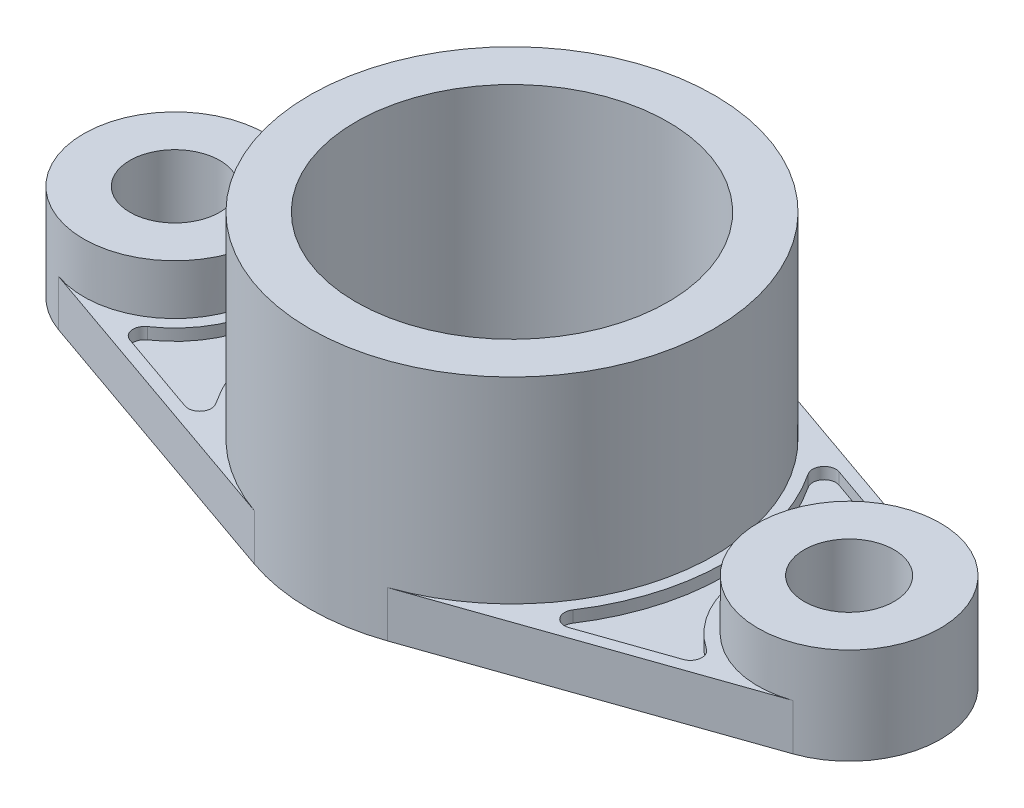
ISO-10303-21;
HEADER;
FILE_DESCRIPTION(('STEP AP214'),'2;1');
FILE_NAME('part.step','',(''),(''),'','','');
FILE_SCHEMA(('AUTOMOTIVE_DESIGN { 1 0 10303 214 1 1 1 1 }'));
ENDSEC;
DATA;
#1=APPLICATION_CONTEXT('core data for automotive mechanical design processes');
#2=APPLICATION_PROTOCOL_DEFINITION('international standard','automotive_design',2000,#1);
#3=PRODUCT_CONTEXT('',#1,'mechanical');
#4=PRODUCT('Part','Part','',(#3));
#5=PRODUCT_RELATED_PRODUCT_CATEGORY('part','',(#4));
#6=PRODUCT_DEFINITION_FORMATION('','',#4);
#7=PRODUCT_DEFINITION_CONTEXT('part definition',#1,'design');
#8=PRODUCT_DEFINITION('design','',#6,#7);
#9=PRODUCT_DEFINITION_SHAPE('','',#8);
#10=(LENGTH_UNIT() NAMED_UNIT(*) SI_UNIT(.MILLI.,.METRE.));
#11=(NAMED_UNIT(*) PLANE_ANGLE_UNIT() SI_UNIT($,.RADIAN.));
#12=(NAMED_UNIT(*) SI_UNIT($,.STERADIAN.) SOLID_ANGLE_UNIT());
#13=UNCERTAINTY_MEASURE_WITH_UNIT(LENGTH_MEASURE(1.E-05),#10,'distance_accuracy_value','');
#14=(GEOMETRIC_REPRESENTATION_CONTEXT(3) GLOBAL_UNCERTAINTY_ASSIGNED_CONTEXT((#13)) GLOBAL_UNIT_ASSIGNED_CONTEXT((#10,
#11,#12)) REPRESENTATION_CONTEXT('',''));
#15=CARTESIAN_POINT('',(0.,0.,0.));
#16=DIRECTION('',(0.,0.,1.));
#17=DIRECTION('',(1.,0.,0.));
#18=AXIS2_PLACEMENT_3D('',#15,#16,#17);
#19=CARTESIAN_POINT('',(0.,12.,0.));
#20=DIRECTION('',(0.,1.,0.));
#21=DIRECTION('',(0.,0.,1.));
#22=AXIS2_PLACEMENT_3D('',#19,#20,#21);
#23=PLANE('',#22);
#24=DIRECTION('',(0.944140617337334,0.,0.329542857142857));
#25=VECTOR('',#24,1.);
#26=CARTESIAN_POINT('',(-17.301,12.,49.5673824102101));
#27=LINE('',#26,#25);
#28=CARTESIAN_POINT('',(-95.2986317142857,12.,22.343087709288));
#29=VERTEX_POINT('',#28);
#30=CARTESIAN_POINT('',(-17.301,12.,49.5673824102101));
#31=VERTEX_POINT('',#30);
#32=EDGE_CURVE('E219',#29,#31,#27,.T.);
#33=ORIENTED_EDGE('',*,*,#32,.T.);
#34=CARTESIAN_POINT('',(0.,12.,0.));
#35=DIRECTION('',(0.,1.,0.));
#36=DIRECTION('',(0.,0.,1.));
#37=AXIS2_PLACEMENT_3D('',#34,#35,#36);
#38=CIRCLE('',#37,52.5);
#39=CARTESIAN_POINT('',(-17.301,12.,-49.56738241021));
#40=VERTEX_POINT('',#39);
#41=EDGE_CURVE('E239',#31,#40,#38,.F.);
#42=ORIENTED_EDGE('',*,*,#41,.T.);
#43=DIRECTION('',(0.944140617337334,0.,-0.329542857142857));
#44=VECTOR('',#43,1.);
#45=CARTESIAN_POINT('',(-17.301,12.,-49.56738241021));
#46=LINE('',#45,#44);
#47=CARTESIAN_POINT('',(-95.2986317142857,12.,-22.343087709288));
#48=VERTEX_POINT('',#47);
#49=EDGE_CURVE('E272',#48,#40,#46,.T.);
#50=ORIENTED_EDGE('',*,*,#49,.F.);
#51=CARTESIAN_POINT('',(-87.5,12.,0.));
#52=DIRECTION('',(0.,1.,0.));
#53=DIRECTION('',(0.,0.,1.));
#54=AXIS2_PLACEMENT_3D('',#51,#52,#53);
#55=CIRCLE('',#54,23.665);
#56=EDGE_CURVE('E268',#48,#29,#55,.F.);
#57=ORIENTED_EDGE('',*,*,#56,.T.);
#58=EDGE_LOOP('',(#33,#42,#50,#57));
#59=FACE_BOUND('',#58,.T.);
#60=DIRECTION('',(0.944140617337334,0.,0.329542857142857));
#61=VECTOR('',#60,1.);
#62=CARTESIAN_POINT('',(-78.3996228998575,12.,25.0640252480563));
#63=LINE('',#62,#61);
#64=CARTESIAN_POINT('',(-71.8093276206941,12.,27.3643020244495));
#65=VERTEX_POINT('',#64);
#66=CARTESIAN_POINT('',(-49.826038740367,12.,35.0373495493516));
#67=VERTEX_POINT('',#66);
#68=EDGE_CURVE('E498',#65,#67,#63,.T.);
#69=ORIENTED_EDGE('',*,*,#68,.F.);
#70=CARTESIAN_POINT('',(-70.8206990492656,12.,24.5318801724375));
#71=DIRECTION('',(0.,1.,0.));
#72=DIRECTION('',(0.,0.,1.));
#73=AXIS2_PLACEMENT_3D('',#70,#71,#72);
#74=CIRCLE('',#73,3.);
#75=CARTESIAN_POINT('',(-72.507464694039,12.,22.0509888689717));
#76=VERTEX_POINT('',#75);
#77=EDGE_CURVE('E377',#65,#76,#74,.F.);
#78=ORIENTED_EDGE('',*,*,#77,.T.);
#79=CARTESIAN_POINT('',(-87.5,12.,0.));
#80=DIRECTION('',(0.,1.,0.));
#81=DIRECTION('',(0.,0.,1.));
#82=AXIS2_PLACEMENT_3D('',#79,#80,#81);
#83=CIRCLE('',#82,26.665);
#84=CARTESIAN_POINT('',(-72.507464694039,12.,-22.0509888689717));
#85=VERTEX_POINT('',#84);
#86=EDGE_CURVE('E485',#76,#85,#83,.T.);
#87=ORIENTED_EDGE('',*,*,#86,.T.);
#88=CARTESIAN_POINT('',(-70.8206990492656,12.,-24.5318801724374));
#89=DIRECTION('',(0.,1.,0.));
#90=DIRECTION('',(0.,0.,1.));
#91=AXIS2_PLACEMENT_3D('',#88,#89,#90);
#92=CIRCLE('',#91,3.);
#93=CARTESIAN_POINT('',(-71.8093276206942,12.,-27.3643020244494));
#94=VERTEX_POINT('',#93);
#95=EDGE_CURVE('E374',#85,#94,#92,.F.);
#96=ORIENTED_EDGE('',*,*,#95,.T.);
#97=DIRECTION('',(-0.944140617337334,0.,0.329542857142857));
#98=VECTOR('',#97,1.);
#99=CARTESIAN_POINT('',(-40.010112847172,12.,-38.4635004901603));
#100=LINE('',#99,#98);
#101=CARTESIAN_POINT('',(-49.826038740367,12.,-35.0373495493516));
#102=VERTEX_POINT('',#101);
#103=EDGE_CURVE('E489',#102,#94,#100,.T.);
#104=ORIENTED_EDGE('',*,*,#103,.F.);
#105=CARTESIAN_POINT('',(-48.8374101689385,12.,-32.2049276973396));
#106=DIRECTION('',(0.,1.,0.));
#107=DIRECTION('',(0.,0.,1.));
#108=AXIS2_PLACEMENT_3D('',#105,#106,#107);
#109=CIRCLE('',#108,3.);
#110=CARTESIAN_POINT('',(-46.3329275961724,12.,-30.5533929436298));
#111=VERTEX_POINT('',#110);
#112=EDGE_CURVE('E383',#102,#111,#109,.F.);
#113=ORIENTED_EDGE('',*,*,#112,.T.);
#114=CARTESIAN_POINT('',(0.,12.,0.));
#115=DIRECTION('',(0.,1.,0.));
#116=DIRECTION('',(0.,0.,1.));
#117=AXIS2_PLACEMENT_3D('',#114,#115,#116);
#118=CIRCLE('',#117,55.5);
#119=CARTESIAN_POINT('',(-46.3329275961724,12.,30.5533929436299));
#120=VERTEX_POINT('',#119);
#121=EDGE_CURVE('E494',#111,#120,#118,.T.);
#122=ORIENTED_EDGE('',*,*,#121,.T.);
#123=CARTESIAN_POINT('',(-48.8374101689384,12.,32.2049276973396));
#124=DIRECTION('',(0.,1.,0.));
#125=DIRECTION('',(0.,0.,1.));
#126=AXIS2_PLACEMENT_3D('',#123,#124,#125);
#127=CIRCLE('',#126,3.);
#128=EDGE_CURVE('E380',#120,#67,#127,.F.);
#129=ORIENTED_EDGE('',*,*,#128,.T.);
#130=EDGE_LOOP('',(#69,#78,#87,#96,#104,#113,#122,#129));
#131=FACE_BOUND('',#130,.T.);
#132=ADVANCED_FACE('F47',(#59,#131),#23,.T.);
#133=DIRECTION('',(-0.944140617337334,0.,-0.329542857142857));
#134=VECTOR('',#133,1.);
#135=CARTESIAN_POINT('',(17.301,12.,-49.56738241021));
#136=LINE('',#135,#134);
#137=CARTESIAN_POINT('',(95.2986317142857,12.,-22.343087709288));
#138=VERTEX_POINT('',#137);
#139=CARTESIAN_POINT('',(17.301,12.,-49.56738241021));
#140=VERTEX_POINT('',#139);
#141=EDGE_CURVE('E218',#138,#140,#136,.T.);
#142=ORIENTED_EDGE('',*,*,#141,.T.);
#143=CARTESIAN_POINT('',(17.301,12.,49.56738241021));
#144=VERTEX_POINT('',#143);
#145=EDGE_CURVE('E227',#140,#144,#38,.F.);
#146=ORIENTED_EDGE('',*,*,#145,.T.);
#147=DIRECTION('',(-0.944140617337334,0.,0.329542857142857));
#148=VECTOR('',#147,1.);
#149=CARTESIAN_POINT('',(17.301,12.,49.5673824102101));
#150=LINE('',#149,#148);
#151=CARTESIAN_POINT('',(95.2986317142857,12.,22.343087709288));
#152=VERTEX_POINT('',#151);
#153=EDGE_CURVE('E207',#152,#144,#150,.T.);
#154=ORIENTED_EDGE('',*,*,#153,.F.);
#155=CARTESIAN_POINT('',(87.5,12.,0.));
#156=DIRECTION('',(0.,1.,0.));
#157=DIRECTION('',(0.,0.,1.));
#158=AXIS2_PLACEMENT_3D('',#155,#156,#157);
#159=CIRCLE('',#158,23.665);
#160=EDGE_CURVE('E257',#138,#152,#159,.T.);
#161=ORIENTED_EDGE('',*,*,#160,.F.);
#162=EDGE_LOOP('',(#142,#146,#154,#161));
#163=FACE_BOUND('',#162,.T.);
#164=DIRECTION('',(-0.944140617337334,0.,-0.329542857142857));
#165=VECTOR('',#164,1.);
#166=CARTESIAN_POINT('',(78.3996228998575,12.,-25.0640252480563));
#167=LINE('',#166,#165);
#168=CARTESIAN_POINT('',(71.8093276206941,12.,-27.3643020244494));
#169=VERTEX_POINT('',#168);
#170=CARTESIAN_POINT('',(49.826038740367,12.,-35.0373495493516));
#171=VERTEX_POINT('',#170);
#172=EDGE_CURVE('E433',#169,#171,#167,.T.);
#173=ORIENTED_EDGE('',*,*,#172,.F.);
#174=CARTESIAN_POINT('',(70.8206990492656,12.,-24.5318801724374));
#175=DIRECTION('',(0.,1.,0.));
#176=DIRECTION('',(0.,0.,1.));
#177=AXIS2_PLACEMENT_3D('',#174,#175,#176);
#178=CIRCLE('',#177,3.);
#179=CARTESIAN_POINT('',(72.507464694039,12.,-22.0509888689717));
#180=VERTEX_POINT('',#179);
#181=EDGE_CURVE('E428',#169,#180,#178,.F.);
#182=ORIENTED_EDGE('',*,*,#181,.T.);
#183=CARTESIAN_POINT('',(87.5,12.,0.));
#184=DIRECTION('',(0.,1.,0.));
#185=DIRECTION('',(0.,0.,1.));
#186=AXIS2_PLACEMENT_3D('',#183,#184,#185);
#187=CIRCLE('',#186,26.665);
#188=CARTESIAN_POINT('',(72.507464694039,12.,22.0509888689717));
#189=VERTEX_POINT('',#188);
#190=EDGE_CURVE('E490',#180,#189,#187,.T.);
#191=ORIENTED_EDGE('',*,*,#190,.T.);
#192=CARTESIAN_POINT('',(70.8206990492656,12.,24.5318801724375));
#193=DIRECTION('',(0.,1.,0.));
#194=DIRECTION('',(0.,0.,1.));
#195=AXIS2_PLACEMENT_3D('',#192,#193,#194);
#196=CIRCLE('',#195,3.);
#197=CARTESIAN_POINT('',(71.8093276206941,12.,27.3643020244495));
#198=VERTEX_POINT('',#197);
#199=EDGE_CURVE('E425',#189,#198,#196,.F.);
#200=ORIENTED_EDGE('',*,*,#199,.T.);
#201=DIRECTION('',(0.944140617337334,0.,-0.329542857142857));
#202=VECTOR('',#201,1.);
#203=CARTESIAN_POINT('',(40.010112847172,12.,38.4635004901603));
#204=LINE('',#203,#202);
#205=CARTESIAN_POINT('',(49.826038740367,12.,35.0373495493516));
#206=VERTEX_POINT('',#205);
#207=EDGE_CURVE('E505',#206,#198,#204,.T.);
#208=ORIENTED_EDGE('',*,*,#207,.F.);
#209=CARTESIAN_POINT('',(48.8374101689384,12.,32.2049276973396));
#210=DIRECTION('',(0.,1.,0.));
#211=DIRECTION('',(0.,0.,1.));
#212=AXIS2_PLACEMENT_3D('',#209,#210,#211);
#213=CIRCLE('',#212,3.);
#214=CARTESIAN_POINT('',(46.3329275961723,12.,30.5533929436299));
#215=VERTEX_POINT('',#214);
#216=EDGE_CURVE('E11',#206,#215,#213,.F.);
#217=ORIENTED_EDGE('',*,*,#216,.T.);
#218=CARTESIAN_POINT('',(0.,12.,0.));
#219=DIRECTION('',(0.,1.,0.));
#220=DIRECTION('',(0.,0.,1.));
#221=AXIS2_PLACEMENT_3D('',#218,#219,#220);
#222=CIRCLE('',#221,55.5);
#223=CARTESIAN_POINT('',(46.3329275961724,12.,-30.5533929436298));
#224=VERTEX_POINT('',#223);
#225=EDGE_CURVE('E434',#215,#224,#222,.T.);
#226=ORIENTED_EDGE('',*,*,#225,.T.);
#227=CARTESIAN_POINT('',(48.8374101689384,12.,-32.2049276973396));
#228=DIRECTION('',(0.,1.,0.));
#229=DIRECTION('',(0.,0.,1.));
#230=AXIS2_PLACEMENT_3D('',#227,#228,#229);
#231=CIRCLE('',#230,3.);
#232=EDGE_CURVE('E56',#224,#171,#231,.F.);
#233=ORIENTED_EDGE('',*,*,#232,.T.);
#234=EDGE_LOOP('',(#173,#182,#191,#200,#208,#217,#226,#233));
#235=FACE_BOUND('',#234,.T.);
#236=ADVANCED_FACE('F235',(#163,#235),#23,.T.);
#237=CARTESIAN_POINT('',(-17.301,12.,-49.56738241021));
#238=DIRECTION('',(-0.329542857142857,0.,-0.944140617337334));
#239=DIRECTION('',(-0.944140617337334,0.,0.329542857142857));
#240=AXIS2_PLACEMENT_3D('',#237,#238,#239);
#241=PLANE('',#240);
#242=DIRECTION('',(0.944140617337334,0.,-0.329542857142857));
#243=VECTOR('',#242,1.);
#244=CARTESIAN_POINT('',(-17.301,0.,-49.56738241021));
#245=LINE('',#244,#243);
#246=CARTESIAN_POINT('',(-95.2986317142857,0.,-22.343087709288));
#247=VERTEX_POINT('',#246);
#248=CARTESIAN_POINT('',(-17.301,0.,-49.56738241021));
#249=VERTEX_POINT('',#248);
#250=EDGE_CURVE('E271',#247,#249,#245,.T.);
#251=ORIENTED_EDGE('',*,*,#250,.F.);
#252=DIRECTION('',(0.,-1.,0.));
#253=VECTOR('',#252,1.);
#254=CARTESIAN_POINT('',(-95.2986317142857,12.,-22.343087709288));
#255=LINE('',#254,#253);
#256=EDGE_CURVE('E331',#48,#247,#255,.T.);
#257=ORIENTED_EDGE('',*,*,#256,.F.);
#258=ORIENTED_EDGE('',*,*,#49,.T.);
#259=DIRECTION('',(0.,-1.,0.));
#260=VECTOR('',#259,1.);
#261=CARTESIAN_POINT('',(-17.301,12.,-49.56738241021));
#262=LINE('',#261,#260);
#263=EDGE_CURVE('E281',#40,#249,#262,.T.);
#264=ORIENTED_EDGE('',*,*,#263,.T.);
#265=EDGE_LOOP('',(#251,#257,#258,#264));
#266=FACE_BOUND('',#265,.T.);
#267=ADVANCED_FACE('F538',(#266),#241,.T.);
#268=CARTESIAN_POINT('',(-87.5,12.,0.));
#269=DIRECTION('',(0.,-1.,0.));
#270=DIRECTION('',(0.,0.,-1.));
#271=AXIS2_PLACEMENT_3D('',#268,#269,#270);
#272=CYLINDRICAL_SURFACE('',#271,23.665);
#273=CARTESIAN_POINT('',(-87.5,0.,0.));
#274=DIRECTION('',(0.,1.,0.));
#275=DIRECTION('',(0.,0.,1.));
#276=AXIS2_PLACEMENT_3D('',#273,#274,#275);
#277=CIRCLE('',#276,23.665);
#278=CARTESIAN_POINT('',(-95.2986317142857,0.,22.343087709288));
#279=VERTEX_POINT('',#278);
#280=EDGE_CURVE('E285',#247,#279,#277,.T.);
#281=ORIENTED_EDGE('',*,*,#280,.T.);
#282=DIRECTION('',(0.,-1.,0.));
#283=VECTOR('',#282,1.);
#284=CARTESIAN_POINT('',(-95.2986317142857,12.,22.343087709288));
#285=LINE('',#284,#283);
#286=EDGE_CURVE('E327',#29,#279,#285,.T.);
#287=ORIENTED_EDGE('',*,*,#286,.F.);
#288=ORIENTED_EDGE('',*,*,#56,.F.);
#289=ORIENTED_EDGE('',*,*,#256,.T.);
#290=EDGE_LOOP('',(#281,#287,#288,#289));
#291=FACE_BOUND('',#290,.T.);
#292=CARTESIAN_POINT('',(-87.5,25.,0.));
#293=DIRECTION('',(0.,1.,0.));
#294=DIRECTION('',(0.,0.,1.));
#295=AXIS2_PLACEMENT_3D('',#292,#293,#294);
#296=CIRCLE('',#295,23.665);
#297=CARTESIAN_POINT('',(-87.5,25.,23.665));
#298=VERTEX_POINT('',#297);
#299=EDGE_CURVE('E264',#298,#298,#296,.T.);
#300=ORIENTED_EDGE('',*,*,#299,.F.);
#301=EDGE_LOOP('',(#300));
#302=FACE_BOUND('',#301,.T.);
#303=ADVANCED_FACE('F575',(#291,#302),#272,.T.);
#304=CARTESIAN_POINT('',(-17.301,12.,49.5673824102101));
#305=DIRECTION('',(0.329542857142857,0.,-0.944140617337334));
#306=DIRECTION('',(-0.944140617337334,0.,-0.329542857142857));
#307=AXIS2_PLACEMENT_3D('',#304,#305,#306);
#308=PLANE('',#307);
#309=DIRECTION('',(0.944140617337334,0.,0.329542857142857));
#310=VECTOR('',#309,1.);
#311=CARTESIAN_POINT('',(-17.301,0.,49.5673824102101));
#312=LINE('',#311,#310);
#313=CARTESIAN_POINT('',(-17.301,0.,49.5673824102101));
#314=VERTEX_POINT('',#313);
#315=EDGE_CURVE('E288',#279,#314,#312,.T.);
#316=ORIENTED_EDGE('',*,*,#315,.T.);
#317=DIRECTION('',(0.,-1.,0.));
#318=VECTOR('',#317,1.);
#319=CARTESIAN_POINT('',(-17.301,12.,49.5673824102101));
#320=LINE('',#319,#318);
#321=EDGE_CURVE('E233',#31,#314,#320,.T.);
#322=ORIENTED_EDGE('',*,*,#321,.F.);
#323=ORIENTED_EDGE('',*,*,#32,.F.);
#324=ORIENTED_EDGE('',*,*,#286,.T.);
#325=EDGE_LOOP('',(#316,#322,#323,#324));
#326=FACE_BOUND('',#325,.T.);
#327=ADVANCED_FACE('F572',(#326),#308,.F.);
#328=CARTESIAN_POINT('',(17.301,12.,49.5673824102101));
#329=DIRECTION('',(0.329542857142857,0.,0.944140617337334));
#330=DIRECTION('',(0.944140617337334,0.,-0.329542857142857));
#331=AXIS2_PLACEMENT_3D('',#328,#329,#330);
#332=PLANE('',#331);
#333=DIRECTION('',(-0.944140617337334,0.,0.329542857142857));
#334=VECTOR('',#333,1.);
#335=CARTESIAN_POINT('',(17.301,0.,49.5673824102101));
#336=LINE('',#335,#334);
#337=CARTESIAN_POINT('',(95.2986317142857,0.,22.343087709288));
#338=VERTEX_POINT('',#337);
#339=CARTESIAN_POINT('',(17.301,0.,49.5673824102101));
#340=VERTEX_POINT('',#339);
#341=EDGE_CURVE('E293',#338,#340,#336,.T.);
#342=ORIENTED_EDGE('',*,*,#341,.F.);
#343=DIRECTION('',(0.,-1.,0.));
#344=VECTOR('',#343,1.);
#345=CARTESIAN_POINT('',(95.2986317142857,12.,22.343087709288));
#346=LINE('',#345,#344);
#347=EDGE_CURVE('E213',#152,#338,#346,.T.);
#348=ORIENTED_EDGE('',*,*,#347,.F.);
#349=ORIENTED_EDGE('',*,*,#153,.T.);
#350=DIRECTION('',(0.,-1.,0.));
#351=VECTOR('',#350,1.);
#352=CARTESIAN_POINT('',(17.301,12.,49.5673824102101));
#353=LINE('',#352,#351);
#354=EDGE_CURVE('E211',#144,#340,#353,.T.);
#355=ORIENTED_EDGE('',*,*,#354,.T.);
#356=EDGE_LOOP('',(#342,#348,#349,#355));
#357=FACE_BOUND('',#356,.T.);
#358=ADVANCED_FACE('F210',(#357),#332,.T.);
#359=CARTESIAN_POINT('',(87.5,12.,0.));
#360=DIRECTION('',(0.,-1.,0.));
#361=DIRECTION('',(0.,0.,-1.));
#362=AXIS2_PLACEMENT_3D('',#359,#360,#361);
#363=CYLINDRICAL_SURFACE('',#362,23.665);
#364=CARTESIAN_POINT('',(87.5,0.,0.));
#365=DIRECTION('',(0.,1.,0.));
#366=DIRECTION('',(0.,0.,1.));
#367=AXIS2_PLACEMENT_3D('',#364,#365,#366);
#368=CIRCLE('',#367,23.665);
#369=CARTESIAN_POINT('',(95.2986317142857,0.,-22.343087709288));
#370=VERTEX_POINT('',#369);
#371=EDGE_CURVE('E297',#370,#338,#368,.F.);
#372=ORIENTED_EDGE('',*,*,#371,.F.);
#373=DIRECTION('',(0.,-1.,0.));
#374=VECTOR('',#373,1.);
#375=CARTESIAN_POINT('',(95.2986317142857,12.,-22.343087709288));
#376=LINE('',#375,#374);
#377=EDGE_CURVE('E320',#138,#370,#376,.T.);
#378=ORIENTED_EDGE('',*,*,#377,.F.);
#379=ORIENTED_EDGE('',*,*,#160,.T.);
#380=ORIENTED_EDGE('',*,*,#347,.T.);
#381=EDGE_LOOP('',(#372,#378,#379,#380));
#382=FACE_BOUND('',#381,.T.);
#383=CARTESIAN_POINT('',(87.5,25.,0.));
#384=DIRECTION('',(0.,1.,0.));
#385=DIRECTION('',(0.,0.,1.));
#386=AXIS2_PLACEMENT_3D('',#383,#384,#385);
#387=CIRCLE('',#386,23.665);
#388=CARTESIAN_POINT('',(87.5,25.,23.665));
#389=VERTEX_POINT('',#388);
#390=EDGE_CURVE('E244',#389,#389,#387,.F.);
#391=ORIENTED_EDGE('',*,*,#390,.T.);
#392=EDGE_LOOP('',(#391));
#393=FACE_BOUND('',#392,.T.);
#394=ADVANCED_FACE('F565',(#382,#393),#363,.T.);
#395=CARTESIAN_POINT('',(17.301,12.,-49.56738241021));
#396=DIRECTION('',(-0.329542857142857,0.,0.944140617337334));
#397=DIRECTION('',(0.944140617337334,0.,0.329542857142857));
#398=AXIS2_PLACEMENT_3D('',#395,#396,#397);
#399=PLANE('',#398);
#400=DIRECTION('',(-0.944140617337334,0.,-0.329542857142857));
#401=VECTOR('',#400,1.);
#402=CARTESIAN_POINT('',(17.301,0.,-49.56738241021));
#403=LINE('',#402,#401);
#404=CARTESIAN_POINT('',(17.301,0.,-49.56738241021));
#405=VERTEX_POINT('',#404);
#406=EDGE_CURVE('E301',#370,#405,#403,.T.);
#407=ORIENTED_EDGE('',*,*,#406,.T.);
#408=DIRECTION('',(0.,-1.,0.));
#409=VECTOR('',#408,1.);
#410=CARTESIAN_POINT('',(17.301,12.,-49.56738241021));
#411=LINE('',#410,#409);
#412=EDGE_CURVE('E317',#140,#405,#411,.T.);
#413=ORIENTED_EDGE('',*,*,#412,.F.);
#414=ORIENTED_EDGE('',*,*,#141,.F.);
#415=ORIENTED_EDGE('',*,*,#377,.T.);
#416=EDGE_LOOP('',(#407,#413,#414,#415));
#417=FACE_BOUND('',#416,.T.);
#418=ADVANCED_FACE('F556',(#417),#399,.F.);
#419=CARTESIAN_POINT('',(-87.5,12.,0.));
#420=DIRECTION('',(0.,-1.,0.));
#421=DIRECTION('',(0.,0.,-1.));
#422=AXIS2_PLACEMENT_3D('',#419,#420,#421);
#423=CYLINDRICAL_SURFACE('',#422,11.665);
#424=CARTESIAN_POINT('',(-87.5,0.,0.));
#425=DIRECTION('',(0.,1.,0.));
#426=DIRECTION('',(0.,0.,1.));
#427=AXIS2_PLACEMENT_3D('',#424,#425,#426);
#428=CIRCLE('',#427,11.665);
#429=CARTESIAN_POINT('',(-87.5,0.,11.665));
#430=VERTEX_POINT('',#429);
#431=EDGE_CURVE('E308',#430,#430,#428,.T.);
#432=ORIENTED_EDGE('',*,*,#431,.F.);
#433=EDGE_LOOP('',(#432));
#434=FACE_BOUND('',#433,.T.);
#435=CARTESIAN_POINT('',(-87.5,25.,0.));
#436=DIRECTION('',(0.,1.,0.));
#437=DIRECTION('',(0.,0.,1.));
#438=AXIS2_PLACEMENT_3D('',#435,#436,#437);
#439=CIRCLE('',#438,11.665);
#440=CARTESIAN_POINT('',(-87.5,25.,11.665));
#441=VERTEX_POINT('',#440);
#442=EDGE_CURVE('E260',#441,#441,#439,.T.);
#443=ORIENTED_EDGE('',*,*,#442,.T.);
#444=EDGE_LOOP('',(#443));
#445=FACE_BOUND('',#444,.T.);
#446=ADVANCED_FACE('F552',(#434,#445),#423,.F.);
#447=CARTESIAN_POINT('',(0.,12.,0.));
#448=DIRECTION('',(0.,-1.,0.));
#449=DIRECTION('',(0.,0.,-1.));
#450=AXIS2_PLACEMENT_3D('',#447,#448,#449);
#451=CYLINDRICAL_SURFACE('',#450,40.5);
#452=CARTESIAN_POINT('',(0.,0.,0.));
#453=DIRECTION('',(0.,1.,0.));
#454=DIRECTION('',(0.,0.,1.));
#455=AXIS2_PLACEMENT_3D('',#452,#453,#454);
#456=CIRCLE('',#455,40.5);
#457=CARTESIAN_POINT('',(0.,0.,40.5));
#458=VERTEX_POINT('',#457);
#459=EDGE_CURVE('E304',#458,#458,#456,.T.);
#460=ORIENTED_EDGE('',*,*,#459,.F.);
#461=EDGE_LOOP('',(#460));
#462=FACE_BOUND('',#461,.T.);
#463=CARTESIAN_POINT('',(0.,63.,0.));
#464=DIRECTION('',(0.,1.,0.));
#465=DIRECTION('',(0.,0.,1.));
#466=AXIS2_PLACEMENT_3D('',#463,#464,#465);
#467=CIRCLE('',#466,40.5);
#468=CARTESIAN_POINT('',(0.,63.,40.5));
#469=VERTEX_POINT('',#468);
#470=EDGE_CURVE('E246',#469,#469,#467,.T.);
#471=ORIENTED_EDGE('',*,*,#470,.T.);
#472=EDGE_LOOP('',(#471));
#473=FACE_BOUND('',#472,.T.);
#474=ADVANCED_FACE('F555',(#462,#473),#451,.F.);
#475=CARTESIAN_POINT('',(0.,12.,0.));
#476=DIRECTION('',(0.,-1.,0.));
#477=DIRECTION('',(0.,0.,-1.));
#478=AXIS2_PLACEMENT_3D('',#475,#476,#477);
#479=CYLINDRICAL_SURFACE('',#478,52.5);
#480=CARTESIAN_POINT('',(0.,0.,0.));
#481=DIRECTION('',(0.,1.,0.));
#482=DIRECTION('',(0.,0.,1.));
#483=AXIS2_PLACEMENT_3D('',#480,#481,#482);
#484=CIRCLE('',#483,52.5);
#485=EDGE_CURVE('E294',#405,#249,#484,.T.);
#486=ORIENTED_EDGE('',*,*,#485,.T.);
#487=ORIENTED_EDGE('',*,*,#263,.F.);
#488=ORIENTED_EDGE('',*,*,#41,.F.);
#489=ORIENTED_EDGE('',*,*,#321,.T.);
#490=EDGE_CURVE('E230',#314,#340,#484,.T.);
#491=ORIENTED_EDGE('',*,*,#490,.T.);
#492=ORIENTED_EDGE('',*,*,#354,.F.);
#493=ORIENTED_EDGE('',*,*,#145,.F.);
#494=ORIENTED_EDGE('',*,*,#412,.T.);
#495=EDGE_LOOP('',(#486,#487,#488,#489,#491,#492,#493,#494));
#496=FACE_BOUND('',#495,.T.);
#497=CARTESIAN_POINT('',(0.,63.,0.));
#498=DIRECTION('',(0.,1.,0.));
#499=DIRECTION('',(0.,0.,1.));
#500=AXIS2_PLACEMENT_3D('',#497,#498,#499);
#501=CIRCLE('',#500,52.5);
#502=CARTESIAN_POINT('',(0.,63.,52.5));
#503=VERTEX_POINT('',#502);
#504=EDGE_CURVE('E240',#503,#503,#501,.T.);
#505=ORIENTED_EDGE('',*,*,#504,.F.);
#506=EDGE_LOOP('',(#505));
#507=FACE_BOUND('',#506,.T.);
#508=ADVANCED_FACE('F224',(#496,#507),#479,.T.);
#509=CARTESIAN_POINT('',(87.5,12.,0.));
#510=DIRECTION('',(0.,-1.,0.));
#511=DIRECTION('',(0.,0.,-1.));
#512=AXIS2_PLACEMENT_3D('',#509,#510,#511);
#513=CYLINDRICAL_SURFACE('',#512,11.665);
#514=CARTESIAN_POINT('',(87.5,0.,0.));
#515=DIRECTION('',(0.,1.,0.));
#516=DIRECTION('',(0.,0.,1.));
#517=AXIS2_PLACEMENT_3D('',#514,#515,#516);
#518=CIRCLE('',#517,11.665);
#519=CARTESIAN_POINT('',(87.5,0.,11.665));
#520=VERTEX_POINT('',#519);
#521=EDGE_CURVE('E276',#520,#520,#518,.F.);
#522=ORIENTED_EDGE('',*,*,#521,.T.);
#523=EDGE_LOOP('',(#522));
#524=FACE_BOUND('',#523,.T.);
#525=CARTESIAN_POINT('',(87.5,25.,0.));
#526=DIRECTION('',(0.,1.,0.));
#527=DIRECTION('',(0.,0.,1.));
#528=AXIS2_PLACEMENT_3D('',#525,#526,#527);
#529=CIRCLE('',#528,11.665);
#530=CARTESIAN_POINT('',(87.5,25.,11.665));
#531=VERTEX_POINT('',#530);
#532=EDGE_CURVE('E253',#531,#531,#529,.F.);
#533=ORIENTED_EDGE('',*,*,#532,.F.);
#534=EDGE_LOOP('',(#533));
#535=FACE_BOUND('',#534,.T.);
#536=ADVANCED_FACE('F547',(#524,#535),#513,.F.);
#537=CARTESIAN_POINT('',(0.,0.,0.));
#538=DIRECTION('',(0.,1.,0.));
#539=DIRECTION('',(0.,0.,1.));
#540=AXIS2_PLACEMENT_3D('',#537,#538,#539);
#541=PLANE('',#540);
#542=ORIENTED_EDGE('',*,*,#490,.F.);
#543=ORIENTED_EDGE('',*,*,#315,.F.);
#544=ORIENTED_EDGE('',*,*,#280,.F.);
#545=ORIENTED_EDGE('',*,*,#250,.T.);
#546=ORIENTED_EDGE('',*,*,#485,.F.);
#547=ORIENTED_EDGE('',*,*,#406,.F.);
#548=ORIENTED_EDGE('',*,*,#371,.T.);
#549=ORIENTED_EDGE('',*,*,#341,.T.);
#550=EDGE_LOOP('',(#542,#543,#544,#545,#546,#547,#548,#549));
#551=FACE_BOUND('',#550,.T.);
#552=ORIENTED_EDGE('',*,*,#459,.T.);
#553=EDGE_LOOP('',(#552));
#554=FACE_BOUND('',#553,.T.);
#555=ORIENTED_EDGE('',*,*,#521,.F.);
#556=EDGE_LOOP('',(#555));
#557=FACE_BOUND('',#556,.T.);
#558=ORIENTED_EDGE('',*,*,#431,.T.);
#559=EDGE_LOOP('',(#558));
#560=FACE_BOUND('',#559,.T.);
#561=ADVANCED_FACE('F544',(#551,#554,#557,#560),#541,.F.);
#562=CARTESIAN_POINT('',(0.,25.,0.));
#563=DIRECTION('',(0.,1.,0.));
#564=DIRECTION('',(0.,0.,1.));
#565=AXIS2_PLACEMENT_3D('',#562,#563,#564);
#566=PLANE('',#565);
#567=ORIENTED_EDGE('',*,*,#442,.F.);
#568=EDGE_LOOP('',(#567));
#569=FACE_BOUND('',#568,.T.);
#570=ORIENTED_EDGE('',*,*,#299,.T.);
#571=EDGE_LOOP('',(#570));
#572=FACE_BOUND('',#571,.T.);
#573=ADVANCED_FACE('F542',(#569,#572),#566,.T.);
#574=CARTESIAN_POINT('',(0.,25.,0.));
#575=DIRECTION('',(0.,1.,0.));
#576=DIRECTION('',(0.,0.,1.));
#577=AXIS2_PLACEMENT_3D('',#574,#575,#576);
#578=PLANE('',#577);
#579=ORIENTED_EDGE('',*,*,#390,.F.);
#580=EDGE_LOOP('',(#579));
#581=FACE_BOUND('',#580,.T.);
#582=ORIENTED_EDGE('',*,*,#532,.T.);
#583=EDGE_LOOP('',(#582));
#584=FACE_BOUND('',#583,.T.);
#585=ADVANCED_FACE('F764',(#581,#584),#578,.T.);
#586=CARTESIAN_POINT('',(0.,63.,0.));
#587=DIRECTION('',(0.,1.,0.));
#588=DIRECTION('',(0.,0.,1.));
#589=AXIS2_PLACEMENT_3D('',#586,#587,#588);
#590=PLANE('',#589);
#591=ORIENTED_EDGE('',*,*,#470,.F.);
#592=EDGE_LOOP('',(#591));
#593=FACE_BOUND('',#592,.T.);
#594=ORIENTED_EDGE('',*,*,#504,.T.);
#595=EDGE_LOOP('',(#594));
#596=FACE_BOUND('',#595,.T.);
#597=ADVANCED_FACE('F741',(#593,#596),#590,.T.);
#598=CARTESIAN_POINT('',(87.5,9.,0.));
#599=DIRECTION('',(0.,1.,0.));
#600=DIRECTION('',(0.,0.,1.));
#601=AXIS2_PLACEMENT_3D('',#598,#599,#600);
#602=CYLINDRICAL_SURFACE('',#601,26.665);
#603=CARTESIAN_POINT('',(87.5,9.,0.));
#604=DIRECTION('',(0.,1.,0.));
#605=DIRECTION('',(0.,0.,1.));
#606=AXIS2_PLACEMENT_3D('',#603,#604,#605);
#607=CIRCLE('',#606,26.665);
#608=CARTESIAN_POINT('',(72.507464694039,9.,-22.0509888689717));
#609=VERTEX_POINT('',#608);
#610=CARTESIAN_POINT('',(72.507464694039,9.,22.0509888689717));
#611=VERTEX_POINT('',#610);
#612=EDGE_CURVE('E441',#609,#611,#607,.T.);
#613=ORIENTED_EDGE('',*,*,#612,.T.);
#614=DIRECTION('',(0.,1.,0.));
#615=VECTOR('',#614,1.);
#616=CARTESIAN_POINT('',(72.507464694039,9.,22.0509888689717));
#617=LINE('',#616,#615);
#618=EDGE_CURVE('E389',#611,#189,#617,.T.);
#619=ORIENTED_EDGE('',*,*,#618,.T.);
#620=ORIENTED_EDGE('',*,*,#190,.F.);
#621=DIRECTION('',(0.,1.,0.));
#622=VECTOR('',#621,1.);
#623=CARTESIAN_POINT('',(72.507464694039,9.,-22.0509888689717));
#624=LINE('',#623,#622);
#625=EDGE_CURVE('E386',#180,#609,#624,.F.);
#626=ORIENTED_EDGE('',*,*,#625,.T.);
#627=EDGE_LOOP('',(#613,#619,#620,#626));
#628=FACE_BOUND('',#627,.T.);
#629=ADVANCED_FACE('F513',(#628),#602,.T.);
#630=CARTESIAN_POINT('',(40.010112847172,9.,38.4635004901603));
#631=DIRECTION('',(0.329542857142857,0.,0.944140617337334));
#632=DIRECTION('',(0.944140617337334,0.,-0.329542857142857));
#633=AXIS2_PLACEMENT_3D('',#630,#631,#632);
#634=PLANE('',#633);
#635=ORIENTED_EDGE('',*,*,#207,.T.);
#636=DIRECTION('',(0.,1.,0.));
#637=VECTOR('',#636,1.);
#638=CARTESIAN_POINT('',(71.8093276206941,9.,27.3643020244495));
#639=LINE('',#638,#637);
#640=CARTESIAN_POINT('',(71.8093276206941,9.,27.3643020244495));
#641=VERTEX_POINT('',#640);
#642=EDGE_CURVE('E397',#198,#641,#639,.F.);
#643=ORIENTED_EDGE('',*,*,#642,.T.);
#644=DIRECTION('',(0.944140617337334,0.,-0.329542857142857));
#645=VECTOR('',#644,1.);
#646=CARTESIAN_POINT('',(40.010112847172,9.,38.4635004901603));
#647=LINE('',#646,#645);
#648=CARTESIAN_POINT('',(49.826038740367,9.,35.0373495493516));
#649=VERTEX_POINT('',#648);
#650=EDGE_CURVE('E457',#649,#641,#647,.T.);
#651=ORIENTED_EDGE('',*,*,#650,.F.);
#652=DIRECTION('',(0.,1.,0.));
#653=VECTOR('',#652,1.);
#654=CARTESIAN_POINT('',(49.826038740367,9.,35.0373495493516));
#655=LINE('',#654,#653);
#656=EDGE_CURVE('E393',#649,#206,#655,.T.);
#657=ORIENTED_EDGE('',*,*,#656,.T.);
#658=EDGE_LOOP('',(#635,#643,#651,#657));
#659=FACE_BOUND('',#658,.T.);
#660=ADVANCED_FACE('F525',(#659),#634,.F.);
#661=CARTESIAN_POINT('',(0.,9.,0.));
#662=DIRECTION('',(0.,1.,0.));
#663=DIRECTION('',(0.,0.,1.));
#664=AXIS2_PLACEMENT_3D('',#661,#662,#663);
#665=CYLINDRICAL_SURFACE('',#664,55.5);
#666=CARTESIAN_POINT('',(0.,9.,0.));
#667=DIRECTION('',(0.,1.,0.));
#668=DIRECTION('',(0.,0.,1.));
#669=AXIS2_PLACEMENT_3D('',#666,#667,#668);
#670=CIRCLE('',#669,55.5);
#671=CARTESIAN_POINT('',(46.3329275961723,9.,30.5533929436299));
#672=VERTEX_POINT('',#671);
#673=CARTESIAN_POINT('',(46.3329275961724,9.,-30.5533929436298));
#674=VERTEX_POINT('',#673);
#675=EDGE_CURVE('E450',#672,#674,#670,.T.);
#676=ORIENTED_EDGE('',*,*,#675,.T.);
#677=DIRECTION('',(0.,1.,0.));
#678=VECTOR('',#677,1.);
#679=CARTESIAN_POINT('',(46.3329275961724,9.,-30.5533929436298));
#680=LINE('',#679,#678);
#681=EDGE_CURVE('E422',#674,#224,#680,.T.);
#682=ORIENTED_EDGE('',*,*,#681,.T.);
#683=ORIENTED_EDGE('',*,*,#225,.F.);
#684=DIRECTION('',(0.,1.,0.));
#685=VECTOR('',#684,1.);
#686=CARTESIAN_POINT('',(46.3329275961723,9.,30.5533929436299));
#687=LINE('',#686,#685);
#688=EDGE_CURVE('E419',#215,#672,#687,.F.);
#689=ORIENTED_EDGE('',*,*,#688,.T.);
#690=EDGE_LOOP('',(#676,#682,#683,#689));
#691=FACE_BOUND('',#690,.T.);
#692=ADVANCED_FACE('F454',(#691),#665,.T.);
#693=CARTESIAN_POINT('',(78.3996228998575,9.,-25.0640252480563));
#694=DIRECTION('',(0.329542857142857,0.,-0.944140617337334));
#695=DIRECTION('',(-0.944140617337334,0.,-0.329542857142857));
#696=AXIS2_PLACEMENT_3D('',#693,#694,#695);
#697=PLANE('',#696);
#698=DIRECTION('',(-0.944140617337334,0.,-0.329542857142857));
#699=VECTOR('',#698,1.);
#700=CARTESIAN_POINT('',(78.3996228998575,9.,-25.0640252480563));
#701=LINE('',#700,#699);
#702=CARTESIAN_POINT('',(71.8093276206941,9.,-27.3643020244494));
#703=VERTEX_POINT('',#702);
#704=CARTESIAN_POINT('',(49.826038740367,9.,-35.0373495493516));
#705=VERTEX_POINT('',#704);
#706=EDGE_CURVE('E452',#703,#705,#701,.T.);
#707=ORIENTED_EDGE('',*,*,#706,.F.);
#708=DIRECTION('',(0.,1.,0.));
#709=VECTOR('',#708,1.);
#710=CARTESIAN_POINT('',(71.8093276206941,9.,-27.3643020244494));
#711=LINE('',#710,#709);
#712=EDGE_CURVE('E415',#703,#169,#711,.T.);
#713=ORIENTED_EDGE('',*,*,#712,.T.);
#714=ORIENTED_EDGE('',*,*,#172,.T.);
#715=DIRECTION('',(0.,1.,0.));
#716=VECTOR('',#715,1.);
#717=CARTESIAN_POINT('',(49.826038740367,9.,-35.0373495493516));
#718=LINE('',#717,#716);
#719=EDGE_CURVE('E412',#171,#705,#718,.F.);
#720=ORIENTED_EDGE('',*,*,#719,.T.);
#721=EDGE_LOOP('',(#707,#713,#714,#720));
#722=FACE_BOUND('',#721,.T.);
#723=ADVANCED_FACE('F437',(#722),#697,.F.);
#724=CARTESIAN_POINT('',(87.5,9.,0.));
#725=DIRECTION('',(0.,1.,0.));
#726=DIRECTION('',(0.,0.,1.));
#727=AXIS2_PLACEMENT_3D('',#724,#725,#726);
#728=PLANE('',#727);
#729=ORIENTED_EDGE('',*,*,#650,.T.);
#730=CARTESIAN_POINT('',(70.8206990492656,9.,24.5318801724375));
#731=DIRECTION('',(0.,1.,0.));
#732=DIRECTION('',(0.,0.,1.));
#733=AXIS2_PLACEMENT_3D('',#730,#731,#732);
#734=CIRCLE('',#733,3.);
#735=EDGE_CURVE('E409',#641,#611,#734,.T.);
#736=ORIENTED_EDGE('',*,*,#735,.T.);
#737=ORIENTED_EDGE('',*,*,#612,.F.);
#738=CARTESIAN_POINT('',(70.8206990492656,9.,-24.5318801724374));
#739=DIRECTION('',(0.,1.,0.));
#740=DIRECTION('',(0.,0.,1.));
#741=AXIS2_PLACEMENT_3D('',#738,#739,#740);
#742=CIRCLE('',#741,3.);
#743=EDGE_CURVE('E406',#609,#703,#742,.T.);
#744=ORIENTED_EDGE('',*,*,#743,.T.);
#745=ORIENTED_EDGE('',*,*,#706,.T.);
#746=CARTESIAN_POINT('',(48.8374101689384,9.,-32.2049276973396));
#747=DIRECTION('',(0.,1.,0.));
#748=DIRECTION('',(0.,0.,1.));
#749=AXIS2_PLACEMENT_3D('',#746,#747,#748);
#750=CIRCLE('',#749,3.);
#751=EDGE_CURVE('E403',#705,#674,#750,.T.);
#752=ORIENTED_EDGE('',*,*,#751,.T.);
#753=ORIENTED_EDGE('',*,*,#675,.F.);
#754=CARTESIAN_POINT('',(48.8374101689384,9.,32.2049276973396));
#755=DIRECTION('',(0.,1.,0.));
#756=DIRECTION('',(0.,0.,1.));
#757=AXIS2_PLACEMENT_3D('',#754,#755,#756);
#758=CIRCLE('',#757,3.);
#759=EDGE_CURVE('E400',#672,#649,#758,.T.);
#760=ORIENTED_EDGE('',*,*,#759,.T.);
#761=EDGE_LOOP('',(#729,#736,#737,#744,#745,#752,#753,#760));
#762=FACE_BOUND('',#761,.T.);
#763=ADVANCED_FACE('F449',(#762),#728,.T.);
#764=CARTESIAN_POINT('',(-87.5,9.,0.));
#765=DIRECTION('',(0.,1.,0.));
#766=DIRECTION('',(0.,0.,1.));
#767=AXIS2_PLACEMENT_3D('',#764,#765,#766);
#768=CYLINDRICAL_SURFACE('',#767,26.665);
#769=CARTESIAN_POINT('',(-87.5,9.,0.));
#770=DIRECTION('',(0.,1.,0.));
#771=DIRECTION('',(0.,0.,1.));
#772=AXIS2_PLACEMENT_3D('',#769,#770,#771);
#773=CIRCLE('',#772,26.665);
#774=CARTESIAN_POINT('',(-72.507464694039,9.,22.0509888689717));
#775=VERTEX_POINT('',#774);
#776=CARTESIAN_POINT('',(-72.507464694039,9.,-22.0509888689717));
#777=VERTEX_POINT('',#776);
#778=EDGE_CURVE('E501',#775,#777,#773,.T.);
#779=ORIENTED_EDGE('',*,*,#778,.T.);
#780=DIRECTION('',(0.,1.,0.));
#781=VECTOR('',#780,1.);
#782=CARTESIAN_POINT('',(-72.507464694039,9.,-22.0509888689717));
#783=LINE('',#782,#781);
#784=EDGE_CURVE('E337',#777,#85,#783,.T.);
#785=ORIENTED_EDGE('',*,*,#784,.T.);
#786=ORIENTED_EDGE('',*,*,#86,.F.);
#787=DIRECTION('',(0.,1.,0.));
#788=VECTOR('',#787,1.);
#789=CARTESIAN_POINT('',(-72.507464694039,9.,22.0509888689717));
#790=LINE('',#789,#788);
#791=EDGE_CURVE('E334',#76,#775,#790,.F.);
#792=ORIENTED_EDGE('',*,*,#791,.T.);
#793=EDGE_LOOP('',(#779,#785,#786,#792));
#794=FACE_BOUND('',#793,.T.);
#795=ADVANCED_FACE('F690',(#794),#768,.T.);
#796=CARTESIAN_POINT('',(-40.010112847172,9.,-38.4635004901603));
#797=DIRECTION('',(-0.329542857142857,0.,-0.944140617337334));
#798=DIRECTION('',(-0.944140617337334,0.,0.329542857142857));
#799=AXIS2_PLACEMENT_3D('',#796,#797,#798);
#800=PLANE('',#799);
#801=ORIENTED_EDGE('',*,*,#103,.T.);
#802=DIRECTION('',(0.,1.,0.));
#803=VECTOR('',#802,1.);
#804=CARTESIAN_POINT('',(-71.8093276206941,9.,-27.3643020244494));
#805=LINE('',#804,#803);
#806=CARTESIAN_POINT('',(-71.8093276206942,9.,-27.3643020244494));
#807=VERTEX_POINT('',#806);
#808=EDGE_CURVE('E345',#94,#807,#805,.F.);
#809=ORIENTED_EDGE('',*,*,#808,.T.);
#810=DIRECTION('',(-0.944140617337334,0.,0.329542857142857));
#811=VECTOR('',#810,1.);
#812=CARTESIAN_POINT('',(-40.010112847172,9.,-38.4635004901603));
#813=LINE('',#812,#811);
#814=CARTESIAN_POINT('',(-49.826038740367,9.,-35.0373495493516));
#815=VERTEX_POINT('',#814);
#816=EDGE_CURVE('E481',#815,#807,#813,.T.);
#817=ORIENTED_EDGE('',*,*,#816,.F.);
#818=DIRECTION('',(0.,1.,0.));
#819=VECTOR('',#818,1.);
#820=CARTESIAN_POINT('',(-49.826038740367,9.,-35.0373495493516));
#821=LINE('',#820,#819);
#822=EDGE_CURVE('E341',#815,#102,#821,.T.);
#823=ORIENTED_EDGE('',*,*,#822,.T.);
#824=EDGE_LOOP('',(#801,#809,#817,#823));
#825=FACE_BOUND('',#824,.T.);
#826=ADVANCED_FACE('F680',(#825),#800,.F.);
#827=CARTESIAN_POINT('',(0.,9.,0.));
#828=DIRECTION('',(0.,1.,0.));
#829=DIRECTION('',(0.,0.,1.));
#830=AXIS2_PLACEMENT_3D('',#827,#828,#829);
#831=CYLINDRICAL_SURFACE('',#830,55.5);
#832=CARTESIAN_POINT('',(0.,9.,0.));
#833=DIRECTION('',(0.,1.,0.));
#834=DIRECTION('',(0.,0.,1.));
#835=AXIS2_PLACEMENT_3D('',#832,#833,#834);
#836=CIRCLE('',#835,55.5);
#837=CARTESIAN_POINT('',(-46.3329275961724,9.,-30.5533929436298));
#838=VERTEX_POINT('',#837);
#839=CARTESIAN_POINT('',(-46.3329275961724,9.,30.5533929436299));
#840=VERTEX_POINT('',#839);
#841=EDGE_CURVE('E474',#838,#840,#836,.T.);
#842=ORIENTED_EDGE('',*,*,#841,.T.);
#843=DIRECTION('',(0.,1.,0.));
#844=VECTOR('',#843,1.);
#845=CARTESIAN_POINT('',(-46.3329275961724,9.,30.5533929436299));
#846=LINE('',#845,#844);
#847=EDGE_CURVE('E370',#840,#120,#846,.T.);
#848=ORIENTED_EDGE('',*,*,#847,.T.);
#849=ORIENTED_EDGE('',*,*,#121,.F.);
#850=DIRECTION('',(0.,1.,0.));
#851=VECTOR('',#850,1.);
#852=CARTESIAN_POINT('',(-46.3329275961724,9.,-30.5533929436298));
#853=LINE('',#852,#851);
#854=EDGE_CURVE('E367',#111,#838,#853,.F.);
#855=ORIENTED_EDGE('',*,*,#854,.T.);
#856=EDGE_LOOP('',(#842,#848,#849,#855));
#857=FACE_BOUND('',#856,.T.);
#858=ADVANCED_FACE('F670',(#857),#831,.T.);
#859=CARTESIAN_POINT('',(-78.3996228998575,9.,25.0640252480563));
#860=DIRECTION('',(-0.329542857142857,0.,0.944140617337334));
#861=DIRECTION('',(0.944140617337334,0.,0.329542857142857));
#862=AXIS2_PLACEMENT_3D('',#859,#860,#861);
#863=PLANE('',#862);
#864=DIRECTION('',(0.944140617337334,0.,0.329542857142857));
#865=VECTOR('',#864,1.);
#866=CARTESIAN_POINT('',(-78.3996228998575,9.,25.0640252480563));
#867=LINE('',#866,#865);
#868=CARTESIAN_POINT('',(-71.8093276206941,9.,27.3643020244495));
#869=VERTEX_POINT('',#868);
#870=CARTESIAN_POINT('',(-49.826038740367,9.,35.0373495493516));
#871=VERTEX_POINT('',#870);
#872=EDGE_CURVE('E469',#869,#871,#867,.T.);
#873=ORIENTED_EDGE('',*,*,#872,.F.);
#874=DIRECTION('',(0.,1.,0.));
#875=VECTOR('',#874,1.);
#876=CARTESIAN_POINT('',(-71.8093276206941,9.,27.3643020244495));
#877=LINE('',#876,#875);
#878=EDGE_CURVE('E363',#869,#65,#877,.T.);
#879=ORIENTED_EDGE('',*,*,#878,.T.);
#880=ORIENTED_EDGE('',*,*,#68,.T.);
#881=DIRECTION('',(0.,1.,0.));
#882=VECTOR('',#881,1.);
#883=CARTESIAN_POINT('',(-49.826038740367,9.,35.0373495493516));
#884=LINE('',#883,#882);
#885=EDGE_CURVE('E360',#67,#871,#884,.F.);
#886=ORIENTED_EDGE('',*,*,#885,.T.);
#887=EDGE_LOOP('',(#873,#879,#880,#886));
#888=FACE_BOUND('',#887,.T.);
#889=ADVANCED_FACE('F661',(#888),#863,.F.);
#890=CARTESIAN_POINT('',(-87.5,9.,0.));
#891=DIRECTION('',(0.,1.,0.));
#892=DIRECTION('',(0.,0.,1.));
#893=AXIS2_PLACEMENT_3D('',#890,#891,#892);
#894=PLANE('',#893);
#895=ORIENTED_EDGE('',*,*,#816,.T.);
#896=CARTESIAN_POINT('',(-70.8206990492656,9.,-24.5318801724374));
#897=DIRECTION('',(0.,1.,0.));
#898=DIRECTION('',(0.,0.,1.));
#899=AXIS2_PLACEMENT_3D('',#896,#897,#898);
#900=CIRCLE('',#899,3.);
#901=EDGE_CURVE('E357',#807,#777,#900,.T.);
#902=ORIENTED_EDGE('',*,*,#901,.T.);
#903=ORIENTED_EDGE('',*,*,#778,.F.);
#904=CARTESIAN_POINT('',(-70.8206990492656,9.,24.5318801724375));
#905=DIRECTION('',(0.,1.,0.));
#906=DIRECTION('',(0.,0.,1.));
#907=AXIS2_PLACEMENT_3D('',#904,#905,#906);
#908=CIRCLE('',#907,3.);
#909=EDGE_CURVE('E354',#775,#869,#908,.T.);
#910=ORIENTED_EDGE('',*,*,#909,.T.);
#911=ORIENTED_EDGE('',*,*,#872,.T.);
#912=CARTESIAN_POINT('',(-48.8374101689384,9.,32.2049276973396));
#913=DIRECTION('',(0.,1.,0.));
#914=DIRECTION('',(0.,0.,1.));
#915=AXIS2_PLACEMENT_3D('',#912,#913,#914);
#916=CIRCLE('',#915,3.);
#917=EDGE_CURVE('E351',#871,#840,#916,.T.);
#918=ORIENTED_EDGE('',*,*,#917,.T.);
#919=ORIENTED_EDGE('',*,*,#841,.F.);
#920=CARTESIAN_POINT('',(-48.8374101689385,9.,-32.2049276973396));
#921=DIRECTION('',(0.,1.,0.));
#922=DIRECTION('',(0.,0.,1.));
#923=AXIS2_PLACEMENT_3D('',#920,#921,#922);
#924=CIRCLE('',#923,3.);
#925=EDGE_CURVE('E348',#838,#815,#924,.T.);
#926=ORIENTED_EDGE('',*,*,#925,.T.);
#927=EDGE_LOOP('',(#895,#902,#903,#910,#911,#918,#919,#926));
#928=FACE_BOUND('',#927,.T.);
#929=ADVANCED_FACE('F587',(#928),#894,.T.);
#930=CARTESIAN_POINT('',(-70.8206990492656,9.,-24.5318801724374));
#931=DIRECTION('',(0.,1.,0.));
#932=DIRECTION('',(0.,0.,1.));
#933=AXIS2_PLACEMENT_3D('',#930,#931,#932);
#934=CYLINDRICAL_SURFACE('',#933,3.);
#935=ORIENTED_EDGE('',*,*,#901,.F.);
#936=ORIENTED_EDGE('',*,*,#808,.F.);
#937=ORIENTED_EDGE('',*,*,#95,.F.);
#938=ORIENTED_EDGE('',*,*,#784,.F.);
#939=EDGE_LOOP('',(#935,#936,#937,#938));
#940=FACE_BOUND('',#939,.T.);
#941=ADVANCED_FACE('F583',(#940),#934,.F.);
#942=CARTESIAN_POINT('',(-70.8206990492656,9.,24.5318801724375));
#943=DIRECTION('',(0.,1.,0.));
#944=DIRECTION('',(0.,0.,1.));
#945=AXIS2_PLACEMENT_3D('',#942,#943,#944);
#946=CYLINDRICAL_SURFACE('',#945,3.);
#947=ORIENTED_EDGE('',*,*,#909,.F.);
#948=ORIENTED_EDGE('',*,*,#791,.F.);
#949=ORIENTED_EDGE('',*,*,#77,.F.);
#950=ORIENTED_EDGE('',*,*,#878,.F.);
#951=EDGE_LOOP('',(#947,#948,#949,#950));
#952=FACE_BOUND('',#951,.T.);
#953=ADVANCED_FACE('F586',(#952),#946,.F.);
#954=CARTESIAN_POINT('',(-48.8374101689384,9.,32.2049276973396));
#955=DIRECTION('',(0.,1.,0.));
#956=DIRECTION('',(0.,0.,1.));
#957=AXIS2_PLACEMENT_3D('',#954,#955,#956);
#958=CYLINDRICAL_SURFACE('',#957,3.);
#959=ORIENTED_EDGE('',*,*,#917,.F.);
#960=ORIENTED_EDGE('',*,*,#885,.F.);
#961=ORIENTED_EDGE('',*,*,#128,.F.);
#962=ORIENTED_EDGE('',*,*,#847,.F.);
#963=EDGE_LOOP('',(#959,#960,#961,#962));
#964=FACE_BOUND('',#963,.T.);
#965=ADVANCED_FACE('F591',(#964),#958,.F.);
#966=CARTESIAN_POINT('',(-48.8374101689385,9.,-32.2049276973396));
#967=DIRECTION('',(0.,1.,0.));
#968=DIRECTION('',(0.,0.,1.));
#969=AXIS2_PLACEMENT_3D('',#966,#967,#968);
#970=CYLINDRICAL_SURFACE('',#969,3.);
#971=ORIENTED_EDGE('',*,*,#925,.F.);
#972=ORIENTED_EDGE('',*,*,#854,.F.);
#973=ORIENTED_EDGE('',*,*,#112,.F.);
#974=ORIENTED_EDGE('',*,*,#822,.F.);
#975=EDGE_LOOP('',(#971,#972,#973,#974));
#976=FACE_BOUND('',#975,.T.);
#977=ADVANCED_FACE('F595',(#976),#970,.F.);
#978=CARTESIAN_POINT('',(70.8206990492656,9.,24.5318801724375));
#979=DIRECTION('',(0.,1.,0.));
#980=DIRECTION('',(0.,0.,1.));
#981=AXIS2_PLACEMENT_3D('',#978,#979,#980);
#982=CYLINDRICAL_SURFACE('',#981,3.);
#983=ORIENTED_EDGE('',*,*,#735,.F.);
#984=ORIENTED_EDGE('',*,*,#642,.F.);
#985=ORIENTED_EDGE('',*,*,#199,.F.);
#986=ORIENTED_EDGE('',*,*,#618,.F.);
#987=EDGE_LOOP('',(#983,#984,#985,#986));
#988=FACE_BOUND('',#987,.T.);
#989=ADVANCED_FACE('F521',(#988),#982,.F.);
#990=CARTESIAN_POINT('',(70.8206990492656,9.,-24.5318801724374));
#991=DIRECTION('',(0.,1.,0.));
#992=DIRECTION('',(0.,0.,1.));
#993=AXIS2_PLACEMENT_3D('',#990,#991,#992);
#994=CYLINDRICAL_SURFACE('',#993,3.);
#995=ORIENTED_EDGE('',*,*,#743,.F.);
#996=ORIENTED_EDGE('',*,*,#625,.F.);
#997=ORIENTED_EDGE('',*,*,#181,.F.);
#998=ORIENTED_EDGE('',*,*,#712,.F.);
#999=EDGE_LOOP('',(#995,#996,#997,#998));
#1000=FACE_BOUND('',#999,.T.);
#1001=ADVANCED_FACE('F518',(#1000),#994,.F.);
#1002=CARTESIAN_POINT('',(48.8374101689384,9.,-32.2049276973396));
#1003=DIRECTION('',(0.,1.,0.));
#1004=DIRECTION('',(0.,0.,1.));
#1005=AXIS2_PLACEMENT_3D('',#1002,#1003,#1004);
#1006=CYLINDRICAL_SURFACE('',#1005,3.);
#1007=ORIENTED_EDGE('',*,*,#751,.F.);
#1008=ORIENTED_EDGE('',*,*,#719,.F.);
#1009=ORIENTED_EDGE('',*,*,#232,.F.);
#1010=ORIENTED_EDGE('',*,*,#681,.F.);
#1011=EDGE_LOOP('',(#1007,#1008,#1009,#1010));
#1012=FACE_BOUND('',#1011,.T.);
#1013=ADVANCED_FACE('F444',(#1012),#1006,.F.);
#1014=CARTESIAN_POINT('',(48.8374101689384,9.,32.2049276973396));
#1015=DIRECTION('',(0.,1.,0.));
#1016=DIRECTION('',(0.,0.,1.));
#1017=AXIS2_PLACEMENT_3D('',#1014,#1015,#1016);
#1018=CYLINDRICAL_SURFACE('',#1017,3.);
#1019=ORIENTED_EDGE('',*,*,#759,.F.);
#1020=ORIENTED_EDGE('',*,*,#688,.F.);
#1021=ORIENTED_EDGE('',*,*,#216,.F.);
#1022=ORIENTED_EDGE('',*,*,#656,.F.);
#1023=EDGE_LOOP('',(#1019,#1020,#1021,#1022));
#1024=FACE_BOUND('',#1023,.T.);
#1025=ADVANCED_FACE('F49',(#1024),#1018,.F.);
#1026=CLOSED_SHELL('',(#132,#236,#267,#303,#327,#358,#394,#418,#446,#474,#508,#536,#561,#573,
#585,#597,#629,#660,#692,#723,#763,#795,#826,#858,#889,#929,#941,#953,#965,#977,#989,#1001,
#1013,#1025));
#1027=MANIFOLD_SOLID_BREP('B2',#1026);
#1028=ADVANCED_BREP_SHAPE_REPRESENTATION('',(#18,#1027),#14);
#1029=SHAPE_DEFINITION_REPRESENTATION(#9,#1028);
ENDSEC;
END-ISO-10303-21;
